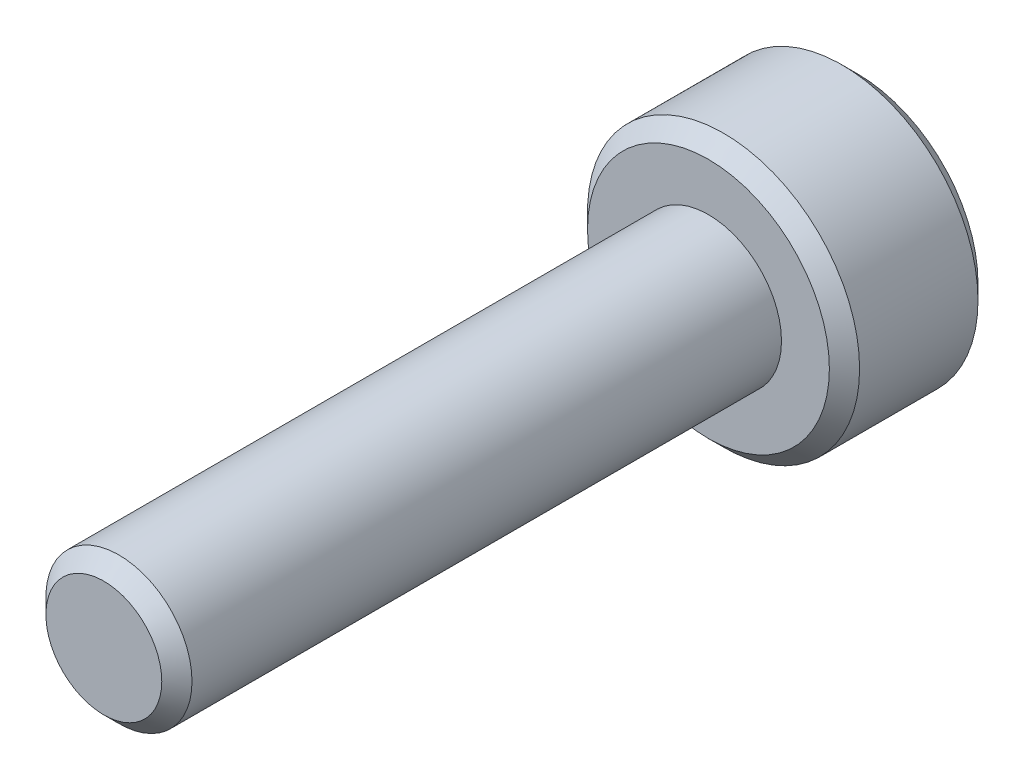
ISO-10303-21;
HEADER;
FILE_DESCRIPTION(('STEP AP214'),'2;1');
FILE_NAME('part.step','',(''),(''),'','','');
FILE_SCHEMA(('AUTOMOTIVE_DESIGN { 1 0 10303 214 1 1 1 1 }'));
ENDSEC;
DATA;
#1=APPLICATION_CONTEXT('core data for automotive mechanical design processes');
#2=APPLICATION_PROTOCOL_DEFINITION('international standard','automotive_design',2000,#1);
#3=PRODUCT_CONTEXT('',#1,'mechanical');
#4=PRODUCT('Part','Part','',(#3));
#5=PRODUCT_RELATED_PRODUCT_CATEGORY('part','',(#4));
#6=PRODUCT_DEFINITION_FORMATION('','',#4);
#7=PRODUCT_DEFINITION_CONTEXT('part definition',#1,'design');
#8=PRODUCT_DEFINITION('design','',#6,#7);
#9=PRODUCT_DEFINITION_SHAPE('','',#8);
#10=(LENGTH_UNIT() NAMED_UNIT(*) SI_UNIT(.MILLI.,.METRE.));
#11=(NAMED_UNIT(*) PLANE_ANGLE_UNIT() SI_UNIT($,.RADIAN.));
#12=(NAMED_UNIT(*) SI_UNIT($,.STERADIAN.) SOLID_ANGLE_UNIT());
#13=UNCERTAINTY_MEASURE_WITH_UNIT(LENGTH_MEASURE(1.E-05),#10,'distance_accuracy_value','');
#14=(GEOMETRIC_REPRESENTATION_CONTEXT(3) GLOBAL_UNCERTAINTY_ASSIGNED_CONTEXT((#13)) GLOBAL_UNIT_ASSIGNED_CONTEXT((#10,
#11,#12)) REPRESENTATION_CONTEXT('',''));
#15=CARTESIAN_POINT('',(0.,0.,0.));
#16=DIRECTION('',(0.,0.,1.));
#17=DIRECTION('',(1.,0.,0.));
#18=AXIS2_PLACEMENT_3D('',#15,#16,#17);
#19=CARTESIAN_POINT('',(0.,0.,2.95));
#20=DIRECTION('',(0.,0.,-1.));
#21=DIRECTION('',(-1.,0.,0.));
#22=AXIS2_PLACEMENT_3D('',#19,#20,#21);
#23=CYLINDRICAL_SURFACE('',#22,2.7);
#24=CARTESIAN_POINT('',(0.,0.,2.65));
#25=DIRECTION('',(0.,0.,1.));
#26=DIRECTION('',(1.,0.,0.));
#27=AXIS2_PLACEMENT_3D('',#24,#25,#26);
#28=CIRCLE('',#27,2.7);
#29=CARTESIAN_POINT('',(2.7,0.,2.65));
#30=VERTEX_POINT('',#29);
#31=EDGE_CURVE('E178',#30,#30,#28,.F.);
#32=ORIENTED_EDGE('',*,*,#31,.T.);
#33=EDGE_LOOP('',(#32));
#34=FACE_BOUND('',#33,.T.);
#35=CARTESIAN_POINT('',(0.,0.,0.300000000000003));
#36=DIRECTION('',(0.,0.,1.));
#37=DIRECTION('',(1.,0.,0.));
#38=AXIS2_PLACEMENT_3D('',#35,#36,#37);
#39=CIRCLE('',#38,2.7);
#40=CARTESIAN_POINT('',(2.7,0.,0.300000000000003));
#41=VERTEX_POINT('',#40);
#42=EDGE_CURVE('E174',#41,#41,#39,.T.);
#43=ORIENTED_EDGE('',*,*,#42,.T.);
#44=EDGE_LOOP('',(#43));
#45=FACE_BOUND('',#44,.T.);
#46=ADVANCED_FACE('F38',(#34,#45),#23,.T.);
#47=CARTESIAN_POINT('',(0.,0.,2.95));
#48=DIRECTION('',(0.,0.,1.));
#49=DIRECTION('',(1.,0.,0.));
#50=AXIS2_PLACEMENT_3D('',#47,#48,#49);
#51=PLANE('',#50);
#52=CARTESIAN_POINT('',(0.,0.,2.95));
#53=DIRECTION('',(0.,0.,1.));
#54=DIRECTION('',(1.,0.,0.));
#55=AXIS2_PLACEMENT_3D('',#52,#53,#54);
#56=CIRCLE('',#55,2.4);
#57=CARTESIAN_POINT('',(2.4,0.,2.95));
#58=VERTEX_POINT('',#57);
#59=EDGE_CURVE('E170',#58,#58,#56,.T.);
#60=ORIENTED_EDGE('',*,*,#59,.T.);
#61=EDGE_LOOP('',(#60));
#62=FACE_BOUND('',#61,.T.);
#63=CARTESIAN_POINT('',(0.,0.,2.95));
#64=DIRECTION('',(0.,0.,1.));
#65=DIRECTION('',(1.,0.,0.));
#66=AXIS2_PLACEMENT_3D('',#63,#64,#65);
#67=CIRCLE('',#66,1.45);
#68=CARTESIAN_POINT('',(1.45,0.,2.95));
#69=VERTEX_POINT('',#68);
#70=EDGE_CURVE('E157',#69,#69,#67,.T.);
#71=ORIENTED_EDGE('',*,*,#70,.F.);
#72=EDGE_LOOP('',(#71));
#73=FACE_BOUND('',#72,.T.);
#74=ADVANCED_FACE('F206',(#62,#73),#51,.T.);
#75=CARTESIAN_POINT('',(0.,0.,0.));
#76=DIRECTION('',(0.,0.,1.));
#77=DIRECTION('',(1.,0.,0.));
#78=AXIS2_PLACEMENT_3D('',#75,#76,#77);
#79=PLANE('',#78);
#80=DIRECTION('',(0.866025403784439,0.5,0.));
#81=VECTOR('',#80,1.);
#82=CARTESIAN_POINT('',(-1.25,0.721687836487032,0.));
#83=LINE('',#82,#81);
#84=CARTESIAN_POINT('',(-1.25,0.721687836487032,0.));
#85=VERTEX_POINT('',#84);
#86=CARTESIAN_POINT('',(0.,1.44337567297406,0.));
#87=VERTEX_POINT('',#86);
#88=EDGE_CURVE('E138',#85,#87,#83,.T.);
#89=ORIENTED_EDGE('',*,*,#88,.F.);
#90=DIRECTION('',(0.,1.,0.));
#91=VECTOR('',#90,1.);
#92=CARTESIAN_POINT('',(-1.25,-0.721687836487032,0.));
#93=LINE('',#92,#91);
#94=CARTESIAN_POINT('',(-1.25,-0.721687836487032,0.));
#95=VERTEX_POINT('',#94);
#96=EDGE_CURVE('E55',#95,#85,#93,.T.);
#97=ORIENTED_EDGE('',*,*,#96,.F.);
#98=DIRECTION('',(-0.866025403784439,0.5,0.));
#99=VECTOR('',#98,1.);
#100=CARTESIAN_POINT('',(0.,-1.44337567297406,0.));
#101=LINE('',#100,#99);
#102=CARTESIAN_POINT('',(0.,-1.44337567297406,0.));
#103=VERTEX_POINT('',#102);
#104=EDGE_CURVE('E151',#103,#95,#101,.T.);
#105=ORIENTED_EDGE('',*,*,#104,.F.);
#106=DIRECTION('',(-0.866025403784439,-0.5,0.));
#107=VECTOR('',#106,1.);
#108=CARTESIAN_POINT('',(1.25,-0.721687836487032,0.));
#109=LINE('',#108,#107);
#110=CARTESIAN_POINT('',(1.25,-0.721687836487032,0.));
#111=VERTEX_POINT('',#110);
#112=EDGE_CURVE('E148',#111,#103,#109,.T.);
#113=ORIENTED_EDGE('',*,*,#112,.F.);
#114=DIRECTION('',(0.,-1.,0.));
#115=VECTOR('',#114,1.);
#116=CARTESIAN_POINT('',(1.25,0.721687836487032,0.));
#117=LINE('',#116,#115);
#118=CARTESIAN_POINT('',(1.25,0.721687836487032,0.));
#119=VERTEX_POINT('',#118);
#120=EDGE_CURVE('E103',#119,#111,#117,.T.);
#121=ORIENTED_EDGE('',*,*,#120,.F.);
#122=DIRECTION('',(0.866025403784439,-0.5,0.));
#123=VECTOR('',#122,1.);
#124=CARTESIAN_POINT('',(0.,1.44337567297406,0.));
#125=LINE('',#124,#123);
#126=EDGE_CURVE('E142',#87,#119,#125,.T.);
#127=ORIENTED_EDGE('',*,*,#126,.F.);
#128=EDGE_LOOP('',(#89,#97,#105,#113,#121,#127));
#129=FACE_BOUND('',#128,.T.);
#130=CARTESIAN_POINT('',(0.,0.,0.));
#131=DIRECTION('',(0.,0.,1.));
#132=DIRECTION('',(1.,0.,0.));
#133=AXIS2_PLACEMENT_3D('',#130,#131,#132);
#134=CIRCLE('',#133,2.4);
#135=CARTESIAN_POINT('',(2.4,0.,0.));
#136=VERTEX_POINT('',#135);
#137=EDGE_CURVE('E182',#136,#136,#134,.F.);
#138=ORIENTED_EDGE('',*,*,#137,.T.);
#139=EDGE_LOOP('',(#138));
#140=FACE_BOUND('',#139,.T.);
#141=ADVANCED_FACE('F212',(#129,#140),#79,.F.);
#142=CARTESIAN_POINT('',(0.,0.,14.95));
#143=DIRECTION('',(0.,0.,-1.));
#144=DIRECTION('',(-1.,0.,0.));
#145=AXIS2_PLACEMENT_3D('',#142,#143,#144);
#146=CYLINDRICAL_SURFACE('',#145,1.45);
#147=CARTESIAN_POINT('',(0.,0.,14.65));
#148=DIRECTION('',(0.,0.,1.));
#149=DIRECTION('',(1.,0.,0.));
#150=AXIS2_PLACEMENT_3D('',#147,#148,#149);
#151=CIRCLE('',#150,1.45);
#152=CARTESIAN_POINT('',(1.45,0.,14.65));
#153=VERTEX_POINT('',#152);
#154=EDGE_CURVE('E11',#153,#153,#151,.F.);
#155=ORIENTED_EDGE('',*,*,#154,.T.);
#156=EDGE_LOOP('',(#155));
#157=FACE_BOUND('',#156,.T.);
#158=ORIENTED_EDGE('',*,*,#70,.T.);
#159=EDGE_LOOP('',(#158));
#160=FACE_BOUND('',#159,.T.);
#161=ADVANCED_FACE('F231',(#157,#160),#146,.T.);
#162=CARTESIAN_POINT('',(0.,0.,14.95));
#163=DIRECTION('',(0.,0.,1.));
#164=DIRECTION('',(1.,0.,0.));
#165=AXIS2_PLACEMENT_3D('',#162,#163,#164);
#166=PLANE('',#165);
#167=CARTESIAN_POINT('',(0.,0.,14.95));
#168=DIRECTION('',(0.,0.,1.));
#169=DIRECTION('',(1.,0.,0.));
#170=AXIS2_PLACEMENT_3D('',#167,#168,#169);
#171=CIRCLE('',#170,1.15);
#172=CARTESIAN_POINT('',(1.15,0.,14.95));
#173=VERTEX_POINT('',#172);
#174=EDGE_CURVE('E48',#173,#173,#171,.T.);
#175=ORIENTED_EDGE('',*,*,#174,.T.);
#176=EDGE_LOOP('',(#175));
#177=FACE_BOUND('',#176,.T.);
#178=ADVANCED_FACE('F190',(#177),#166,.T.);
#179=CARTESIAN_POINT('',(0.,0.,2.95));
#180=DIRECTION('',(0.,0.,-1.));
#181=DIRECTION('',(-1.,0.,0.));
#182=AXIS2_PLACEMENT_3D('',#179,#180,#181);
#183=CONICAL_SURFACE('',#182,2.4,0.785398163397449);
#184=ORIENTED_EDGE('',*,*,#31,.F.);
#185=EDGE_LOOP('',(#184));
#186=FACE_BOUND('',#185,.T.);
#187=ORIENTED_EDGE('',*,*,#59,.F.);
#188=EDGE_LOOP('',(#187));
#189=FACE_BOUND('',#188,.T.);
#190=ADVANCED_FACE('F202',(#186,#189),#183,.T.);
#191=CARTESIAN_POINT('',(0.,0.,0.300000000000003));
#192=DIRECTION('',(0.,0.,1.));
#193=DIRECTION('',(1.,0.,0.));
#194=AXIS2_PLACEMENT_3D('',#191,#192,#193);
#195=CONICAL_SURFACE('',#194,2.7,0.785398163397447);
#196=ORIENTED_EDGE('',*,*,#137,.F.);
#197=EDGE_LOOP('',(#196));
#198=FACE_BOUND('',#197,.T.);
#199=ORIENTED_EDGE('',*,*,#42,.F.);
#200=EDGE_LOOP('',(#199));
#201=FACE_BOUND('',#200,.T.);
#202=ADVANCED_FACE('F194',(#198,#201),#195,.T.);
#203=CARTESIAN_POINT('',(0.,0.,14.95));
#204=DIRECTION('',(0.,0.,-1.));
#205=DIRECTION('',(-1.,0.,0.));
#206=AXIS2_PLACEMENT_3D('',#203,#204,#205);
#207=CONICAL_SURFACE('',#206,1.15,0.785398163397445);
#208=ORIENTED_EDGE('',*,*,#154,.F.);
#209=EDGE_LOOP('',(#208));
#210=FACE_BOUND('',#209,.T.);
#211=ORIENTED_EDGE('',*,*,#174,.F.);
#212=EDGE_LOOP('',(#211));
#213=FACE_BOUND('',#212,.T.);
#214=ADVANCED_FACE('F41',(#210,#213),#207,.T.);
#215=CARTESIAN_POINT('',(-1.25,-0.721687836487032,2.5));
#216=DIRECTION('',(-1.,0.,0.));
#217=DIRECTION('',(0.,-1.,0.));
#218=AXIS2_PLACEMENT_3D('',#215,#216,#217);
#219=PLANE('',#218);
#220=ORIENTED_EDGE('',*,*,#96,.T.);
#221=DIRECTION('',(0.,0.,-1.));
#222=VECTOR('',#221,1.);
#223=CARTESIAN_POINT('',(-1.25,0.721687836487032,2.5));
#224=LINE('',#223,#222);
#225=CARTESIAN_POINT('',(-1.25,0.721687836487032,2.5));
#226=VERTEX_POINT('',#225);
#227=EDGE_CURVE('E85',#226,#85,#224,.T.);
#228=ORIENTED_EDGE('',*,*,#227,.F.);
#229=DIRECTION('',(0.,1.,0.));
#230=VECTOR('',#229,1.);
#231=CARTESIAN_POINT('',(-1.25,-0.721687836487032,2.5));
#232=LINE('',#231,#230);
#233=CARTESIAN_POINT('',(-1.25,-0.721687836487032,2.5));
#234=VERTEX_POINT('',#233);
#235=EDGE_CURVE('E154',#234,#226,#232,.T.);
#236=ORIENTED_EDGE('',*,*,#235,.F.);
#237=DIRECTION('',(0.,0.,-1.));
#238=VECTOR('',#237,1.);
#239=CARTESIAN_POINT('',(-1.25,-0.721687836487032,2.5));
#240=LINE('',#239,#238);
#241=EDGE_CURVE('E63',#234,#95,#240,.T.);
#242=ORIENTED_EDGE('',*,*,#241,.T.);
#243=EDGE_LOOP('',(#220,#228,#236,#242));
#244=FACE_BOUND('',#243,.T.);
#245=ADVANCED_FACE('F193',(#244),#219,.F.);
#246=CARTESIAN_POINT('',(0.,-1.44337567297406,2.5));
#247=DIRECTION('',(-0.5,-0.866025403784439,0.));
#248=DIRECTION('',(0.866025403784439,-0.5,0.));
#249=AXIS2_PLACEMENT_3D('',#246,#247,#248);
#250=PLANE('',#249);
#251=ORIENTED_EDGE('',*,*,#104,.T.);
#252=ORIENTED_EDGE('',*,*,#241,.F.);
#253=DIRECTION('',(-0.866025403784439,0.5,0.));
#254=VECTOR('',#253,1.);
#255=CARTESIAN_POINT('',(0.,-1.44337567297406,2.5));
#256=LINE('',#255,#254);
#257=CARTESIAN_POINT('',(0.,-1.44337567297406,2.5));
#258=VERTEX_POINT('',#257);
#259=EDGE_CURVE('E117',#258,#234,#256,.T.);
#260=ORIENTED_EDGE('',*,*,#259,.F.);
#261=DIRECTION('',(0.,0.,-1.));
#262=VECTOR('',#261,1.);
#263=CARTESIAN_POINT('',(0.,-1.44337567297406,2.5));
#264=LINE('',#263,#262);
#265=EDGE_CURVE('E108',#258,#103,#264,.T.);
#266=ORIENTED_EDGE('',*,*,#265,.T.);
#267=EDGE_LOOP('',(#251,#252,#260,#266));
#268=FACE_BOUND('',#267,.T.);
#269=ADVANCED_FACE('F200',(#268),#250,.F.);
#270=CARTESIAN_POINT('',(1.25,-0.721687836487032,2.5));
#271=DIRECTION('',(0.5,-0.866025403784439,0.));
#272=DIRECTION('',(0.866025403784439,0.5,0.));
#273=AXIS2_PLACEMENT_3D('',#270,#271,#272);
#274=PLANE('',#273);
#275=ORIENTED_EDGE('',*,*,#112,.T.);
#276=ORIENTED_EDGE('',*,*,#265,.F.);
#277=DIRECTION('',(-0.866025403784439,-0.5,0.));
#278=VECTOR('',#277,1.);
#279=CARTESIAN_POINT('',(1.25,-0.721687836487032,2.5));
#280=LINE('',#279,#278);
#281=CARTESIAN_POINT('',(1.25,-0.721687836487032,2.5));
#282=VERTEX_POINT('',#281);
#283=EDGE_CURVE('E112',#282,#258,#280,.T.);
#284=ORIENTED_EDGE('',*,*,#283,.F.);
#285=DIRECTION('',(0.,0.,-1.));
#286=VECTOR('',#285,1.);
#287=CARTESIAN_POINT('',(1.25,-0.721687836487032,2.5));
#288=LINE('',#287,#286);
#289=EDGE_CURVE('E96',#282,#111,#288,.T.);
#290=ORIENTED_EDGE('',*,*,#289,.T.);
#291=EDGE_LOOP('',(#275,#276,#284,#290));
#292=FACE_BOUND('',#291,.T.);
#293=ADVANCED_FACE('F113',(#292),#274,.F.);
#294=CARTESIAN_POINT('',(1.25,0.721687836487032,2.5));
#295=DIRECTION('',(1.,0.,0.));
#296=DIRECTION('',(0.,1.,0.));
#297=AXIS2_PLACEMENT_3D('',#294,#295,#296);
#298=PLANE('',#297);
#299=ORIENTED_EDGE('',*,*,#120,.T.);
#300=ORIENTED_EDGE('',*,*,#289,.F.);
#301=DIRECTION('',(0.,-1.,0.));
#302=VECTOR('',#301,1.);
#303=CARTESIAN_POINT('',(1.25,0.721687836487032,2.5));
#304=LINE('',#303,#302);
#305=CARTESIAN_POINT('',(1.25,0.721687836487032,2.5));
#306=VERTEX_POINT('',#305);
#307=EDGE_CURVE('E100',#306,#282,#304,.T.);
#308=ORIENTED_EDGE('',*,*,#307,.F.);
#309=DIRECTION('',(0.,0.,-1.));
#310=VECTOR('',#309,1.);
#311=CARTESIAN_POINT('',(1.25,0.721687836487032,2.5));
#312=LINE('',#311,#310);
#313=EDGE_CURVE('E109',#306,#119,#312,.T.);
#314=ORIENTED_EDGE('',*,*,#313,.T.);
#315=EDGE_LOOP('',(#299,#300,#308,#314));
#316=FACE_BOUND('',#315,.T.);
#317=ADVANCED_FACE('F98',(#316),#298,.F.);
#318=CARTESIAN_POINT('',(0.,1.44337567297406,2.5));
#319=DIRECTION('',(0.5,0.866025403784438,0.));
#320=DIRECTION('',(-0.866025403784439,0.5,0.));
#321=AXIS2_PLACEMENT_3D('',#318,#319,#320);
#322=PLANE('',#321);
#323=ORIENTED_EDGE('',*,*,#126,.T.);
#324=ORIENTED_EDGE('',*,*,#313,.F.);
#325=DIRECTION('',(0.866025403784439,-0.5,0.));
#326=VECTOR('',#325,1.);
#327=CARTESIAN_POINT('',(0.,1.44337567297406,2.5));
#328=LINE('',#327,#326);
#329=CARTESIAN_POINT('',(0.,1.44337567297406,2.5));
#330=VERTEX_POINT('',#329);
#331=EDGE_CURVE('E123',#330,#306,#328,.T.);
#332=ORIENTED_EDGE('',*,*,#331,.F.);
#333=DIRECTION('',(0.,0.,-1.));
#334=VECTOR('',#333,1.);
#335=CARTESIAN_POINT('',(0.,1.44337567297406,2.5));
#336=LINE('',#335,#334);
#337=EDGE_CURVE('E162',#330,#87,#336,.T.);
#338=ORIENTED_EDGE('',*,*,#337,.T.);
#339=EDGE_LOOP('',(#323,#324,#332,#338));
#340=FACE_BOUND('',#339,.T.);
#341=ADVANCED_FACE('F250',(#340),#322,.F.);
#342=CARTESIAN_POINT('',(-1.25,0.721687836487032,2.5));
#343=DIRECTION('',(-0.5,0.866025403784439,0.));
#344=DIRECTION('',(-0.866025403784439,-0.5,0.));
#345=AXIS2_PLACEMENT_3D('',#342,#343,#344);
#346=PLANE('',#345);
#347=ORIENTED_EDGE('',*,*,#88,.T.);
#348=ORIENTED_EDGE('',*,*,#337,.F.);
#349=DIRECTION('',(0.866025403784439,0.5,0.));
#350=VECTOR('',#349,1.);
#351=CARTESIAN_POINT('',(-1.25,0.721687836487032,2.5));
#352=LINE('',#351,#350);
#353=EDGE_CURVE('E130',#226,#330,#352,.T.);
#354=ORIENTED_EDGE('',*,*,#353,.F.);
#355=ORIENTED_EDGE('',*,*,#227,.T.);
#356=EDGE_LOOP('',(#347,#348,#354,#355));
#357=FACE_BOUND('',#356,.T.);
#358=ADVANCED_FACE('F247',(#357),#346,.F.);
#359=CARTESIAN_POINT('',(0.,0.,2.5));
#360=DIRECTION('',(0.,0.,-1.));
#361=DIRECTION('',(-1.,0.,0.));
#362=AXIS2_PLACEMENT_3D('',#359,#360,#361);
#363=PLANE('',#362);
#364=ORIENTED_EDGE('',*,*,#235,.T.);
#365=ORIENTED_EDGE('',*,*,#353,.T.);
#366=ORIENTED_EDGE('',*,*,#331,.T.);
#367=ORIENTED_EDGE('',*,*,#307,.T.);
#368=ORIENTED_EDGE('',*,*,#283,.T.);
#369=ORIENTED_EDGE('',*,*,#259,.T.);
#370=EDGE_LOOP('',(#364,#365,#366,#367,#368,#369));
#371=FACE_BOUND('',#370,.T.);
#372=ADVANCED_FACE('F120',(#371),#363,.T.);
#373=CLOSED_SHELL('',(#46,#74,#141,#161,#178,#190,#202,#214,#245,#269,#293,#317,#341,#358,#372));
#374=MANIFOLD_SOLID_BREP('B2',#373);
#375=ADVANCED_BREP_SHAPE_REPRESENTATION('',(#18,#374),#14);
#376=SHAPE_DEFINITION_REPRESENTATION(#9,#375);
ENDSEC;
END-ISO-10303-21;
